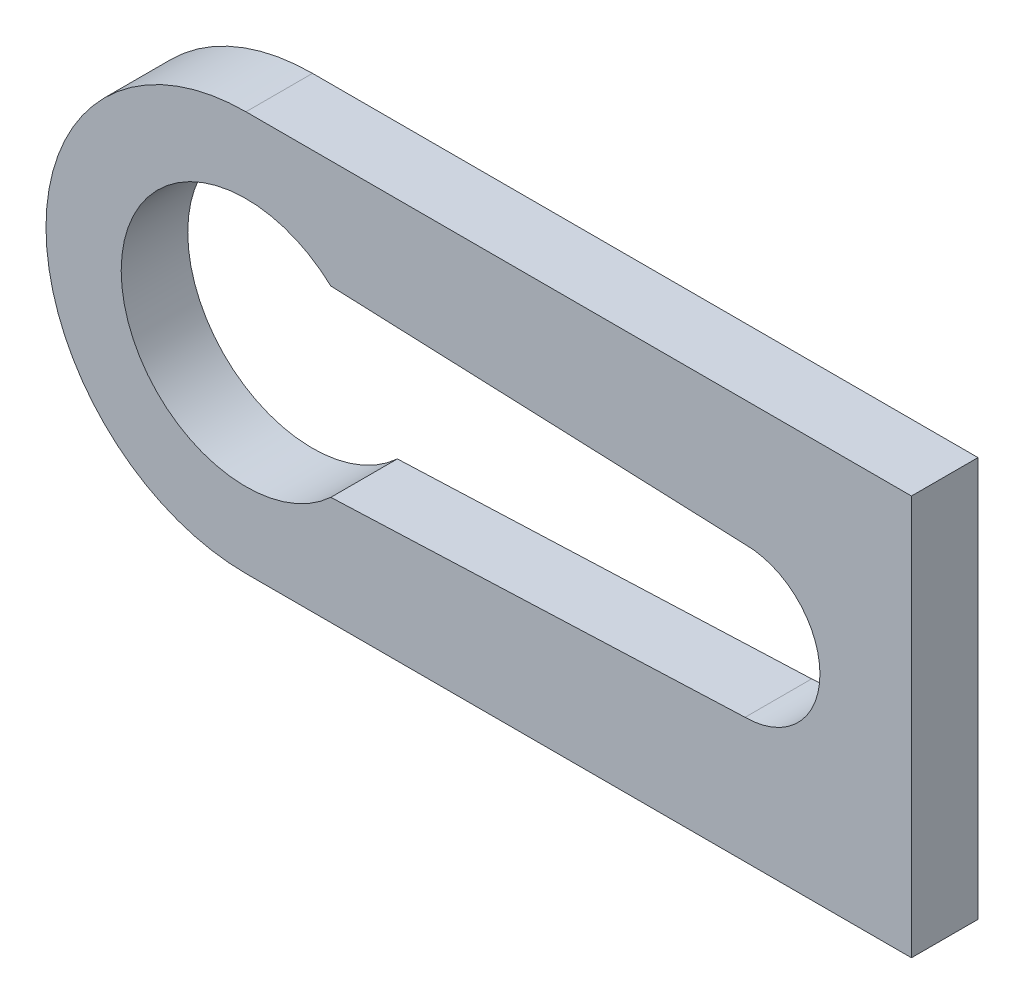
ISO-10303-21;
HEADER;
FILE_DESCRIPTION(('STEP AP214'),'2;1');
FILE_NAME('part.step','',(''),(''),'','','');
FILE_SCHEMA(('AUTOMOTIVE_DESIGN { 1 0 10303 214 1 1 1 1 }'));
ENDSEC;
DATA;
#1=APPLICATION_CONTEXT('core data for automotive mechanical design processes');
#2=APPLICATION_PROTOCOL_DEFINITION('international standard','automotive_design',2000,#1);
#3=PRODUCT_CONTEXT('',#1,'mechanical');
#4=PRODUCT('Part','Part','',(#3));
#5=PRODUCT_RELATED_PRODUCT_CATEGORY('part','',(#4));
#6=PRODUCT_DEFINITION_FORMATION('','',#4);
#7=PRODUCT_DEFINITION_CONTEXT('part definition',#1,'design');
#8=PRODUCT_DEFINITION('design','',#6,#7);
#9=PRODUCT_DEFINITION_SHAPE('','',#8);
#10=(LENGTH_UNIT() NAMED_UNIT(*) SI_UNIT(.MILLI.,.METRE.));
#11=(NAMED_UNIT(*) PLANE_ANGLE_UNIT() SI_UNIT($,.RADIAN.));
#12=(NAMED_UNIT(*) SI_UNIT($,.STERADIAN.) SOLID_ANGLE_UNIT());
#13=UNCERTAINTY_MEASURE_WITH_UNIT(LENGTH_MEASURE(1.E-05),#10,'distance_accuracy_value','');
#14=(GEOMETRIC_REPRESENTATION_CONTEXT(3) GLOBAL_UNCERTAINTY_ASSIGNED_CONTEXT((#13)) GLOBAL_UNIT_ASSIGNED_CONTEXT((#10,
#11,#12)) REPRESENTATION_CONTEXT('',''));
#15=CARTESIAN_POINT('',(0.,0.,0.));
#16=DIRECTION('',(0.,0.,1.));
#17=DIRECTION('',(1.,0.,0.));
#18=AXIS2_PLACEMENT_3D('',#15,#16,#17);
#19=CARTESIAN_POINT('',(0.,6.00975487909238,2.));
#20=DIRECTION('',(0.,1.,0.));
#21=DIRECTION('',(-1.,0.,0.));
#22=AXIS2_PLACEMENT_3D('',#19,#20,#21);
#23=PLANE('',#22);
#24=DIRECTION('',(1.,0.,0.));
#25=VECTOR('',#24,1.);
#26=CARTESIAN_POINT('',(0.,6.00975487909238,0.));
#27=LINE('',#26,#25);
#28=CARTESIAN_POINT('',(-15.,6.00975487909238,0.));
#29=VERTEX_POINT('',#28);
#30=CARTESIAN_POINT('',(5.,6.00975487909238,0.));
#31=VERTEX_POINT('',#30);
#32=EDGE_CURVE('E151',#29,#31,#27,.T.);
#33=ORIENTED_EDGE('',*,*,#32,.F.);
#34=DIRECTION('',(0.,0.,-1.));
#35=VECTOR('',#34,1.);
#36=CARTESIAN_POINT('',(-15.,6.00975487909238,2.));
#37=LINE('',#36,#35);
#38=CARTESIAN_POINT('',(-15.,6.00975487909238,2.));
#39=VERTEX_POINT('',#38);
#40=EDGE_CURVE('E11',#39,#29,#37,.T.);
#41=ORIENTED_EDGE('',*,*,#40,.F.);
#42=DIRECTION('',(1.,0.,0.));
#43=VECTOR('',#42,1.);
#44=CARTESIAN_POINT('',(0.,6.00975487909238,2.));
#45=LINE('',#44,#43);
#46=CARTESIAN_POINT('',(5.,6.00975487909238,2.));
#47=VERTEX_POINT('',#46);
#48=EDGE_CURVE('E123',#39,#47,#45,.T.);
#49=ORIENTED_EDGE('',*,*,#48,.T.);
#50=DIRECTION('',(0.,0.,-1.));
#51=VECTOR('',#50,1.);
#52=CARTESIAN_POINT('',(5.,6.00975487909238,2.));
#53=LINE('',#52,#51);
#54=EDGE_CURVE('E57',#47,#31,#53,.T.);
#55=ORIENTED_EDGE('',*,*,#54,.T.);
#56=EDGE_LOOP('',(#33,#41,#49,#55));
#57=FACE_BOUND('',#56,.T.);
#58=ADVANCED_FACE('F38',(#57),#23,.T.);
#59=CARTESIAN_POINT('',(-15.,0.,2.));
#60=DIRECTION('',(0.,0.,-1.));
#61=DIRECTION('',(-1.,0.,0.));
#62=AXIS2_PLACEMENT_3D('',#59,#60,#61);
#63=CYLINDRICAL_SURFACE('',#62,6.00975487909238);
#64=CARTESIAN_POINT('',(-15.,0.,0.));
#65=DIRECTION('',(0.,0.,1.));
#66=DIRECTION('',(1.,0.,0.));
#67=AXIS2_PLACEMENT_3D('',#64,#65,#66);
#68=CIRCLE('',#67,6.00975487909238);
#69=CARTESIAN_POINT('',(-15.,-6.00975487909238,0.));
#70=VERTEX_POINT('',#69);
#71=EDGE_CURVE('E128',#29,#70,#68,.T.);
#72=ORIENTED_EDGE('',*,*,#71,.T.);
#73=DIRECTION('',(0.,0.,-1.));
#74=VECTOR('',#73,1.);
#75=CARTESIAN_POINT('',(-15.,-6.00975487909238,2.));
#76=LINE('',#75,#74);
#77=CARTESIAN_POINT('',(-15.,-6.00975487909238,2.));
#78=VERTEX_POINT('',#77);
#79=EDGE_CURVE('E48',#78,#70,#76,.T.);
#80=ORIENTED_EDGE('',*,*,#79,.F.);
#81=CARTESIAN_POINT('',(-15.,0.,2.));
#82=DIRECTION('',(0.,0.,1.));
#83=DIRECTION('',(1.,0.,0.));
#84=AXIS2_PLACEMENT_3D('',#81,#82,#83);
#85=CIRCLE('',#84,6.00975487909238);
#86=EDGE_CURVE('E118',#39,#78,#85,.T.);
#87=ORIENTED_EDGE('',*,*,#86,.F.);
#88=ORIENTED_EDGE('',*,*,#40,.T.);
#89=EDGE_LOOP('',(#72,#80,#87,#88));
#90=FACE_BOUND('',#89,.T.);
#91=ADVANCED_FACE('F126',(#90),#63,.T.);
#92=CARTESIAN_POINT('',(0.,-6.00975487909238,2.));
#93=DIRECTION('',(0.,1.,0.));
#94=DIRECTION('',(-1.,0.,0.));
#95=AXIS2_PLACEMENT_3D('',#92,#93,#94);
#96=PLANE('',#95);
#97=DIRECTION('',(1.,0.,0.));
#98=VECTOR('',#97,1.);
#99=CARTESIAN_POINT('',(0.,-6.00975487909238,0.));
#100=LINE('',#99,#98);
#101=CARTESIAN_POINT('',(5.,-6.00975487909238,0.));
#102=VERTEX_POINT('',#101);
#103=EDGE_CURVE('E148',#70,#102,#100,.T.);
#104=ORIENTED_EDGE('',*,*,#103,.T.);
#105=DIRECTION('',(0.,0.,-1.));
#106=VECTOR('',#105,1.);
#107=CARTESIAN_POINT('',(5.,-6.00975487909238,2.));
#108=LINE('',#107,#106);
#109=CARTESIAN_POINT('',(5.,-6.00975487909238,2.));
#110=VERTEX_POINT('',#109);
#111=EDGE_CURVE('E83',#110,#102,#108,.T.);
#112=ORIENTED_EDGE('',*,*,#111,.F.);
#113=DIRECTION('',(1.,0.,0.));
#114=VECTOR('',#113,1.);
#115=CARTESIAN_POINT('',(0.,-6.00975487909238,2.));
#116=LINE('',#115,#114);
#117=EDGE_CURVE('E110',#78,#110,#116,.T.);
#118=ORIENTED_EDGE('',*,*,#117,.F.);
#119=ORIENTED_EDGE('',*,*,#79,.T.);
#120=EDGE_LOOP('',(#104,#112,#118,#119));
#121=FACE_BOUND('',#120,.T.);
#122=ADVANCED_FACE('F112',(#121),#96,.F.);
#123=CARTESIAN_POINT('',(0.,0.,2.));
#124=DIRECTION('',(0.,0.,-1.));
#125=DIRECTION('',(-1.,0.,0.));
#126=AXIS2_PLACEMENT_3D('',#123,#124,#125);
#127=CYLINDRICAL_SURFACE('',#126,2.25);
#128=CARTESIAN_POINT('',(0.,0.,0.));
#129=DIRECTION('',(0.,0.,1.));
#130=DIRECTION('',(1.,0.,0.));
#131=AXIS2_PLACEMENT_3D('',#128,#129,#130);
#132=CIRCLE('',#131,2.25);
#133=CARTESIAN_POINT('',(0.,-2.25,0.));
#134=VERTEX_POINT('',#133);
#135=CARTESIAN_POINT('',(0.,2.25,0.));
#136=VERTEX_POINT('',#135);
#137=EDGE_CURVE('E162',#134,#136,#132,.T.);
#138=ORIENTED_EDGE('',*,*,#137,.F.);
#139=DIRECTION('',(0.,0.,-1.));
#140=VECTOR('',#139,1.);
#141=CARTESIAN_POINT('',(0.,-2.25,2.));
#142=LINE('',#141,#140);
#143=CARTESIAN_POINT('',(0.,-2.25,2.));
#144=VERTEX_POINT('',#143);
#145=EDGE_CURVE('E42',#144,#134,#142,.T.);
#146=ORIENTED_EDGE('',*,*,#145,.F.);
#147=CARTESIAN_POINT('',(0.,0.,2.));
#148=DIRECTION('',(0.,0.,1.));
#149=DIRECTION('',(1.,0.,0.));
#150=AXIS2_PLACEMENT_3D('',#147,#148,#149);
#151=CIRCLE('',#150,2.25);
#152=CARTESIAN_POINT('',(0.,2.25,2.));
#153=VERTEX_POINT('',#152);
#154=EDGE_CURVE('E147',#144,#153,#151,.T.);
#155=ORIENTED_EDGE('',*,*,#154,.T.);
#156=DIRECTION('',(0.,0.,-1.));
#157=VECTOR('',#156,1.);
#158=CARTESIAN_POINT('',(0.,2.25,2.));
#159=LINE('',#158,#157);
#160=EDGE_CURVE('E133',#153,#136,#159,.T.);
#161=ORIENTED_EDGE('',*,*,#160,.T.);
#162=EDGE_LOOP('',(#138,#146,#155,#161));
#163=FACE_BOUND('',#162,.T.);
#164=ADVANCED_FACE('F40',(#163),#127,.F.);
#165=CARTESIAN_POINT('',(0.0902123977015036,-2.24637715479715,2.));
#166=DIRECTION('',(-0.0401267170784004,0.999194598952832,0.));
#167=DIRECTION('',(-0.999194598952832,-0.0401267170784004,0.));
#168=AXIS2_PLACEMENT_3D('',#165,#166,#167);
#169=PLANE('',#168);
#170=DIRECTION('',(0.999194598952832,0.0401267170784004,0.));
#171=VECTOR('',#170,1.);
#172=CARTESIAN_POINT('',(0.0902123977015036,-2.24637715479715,0.));
#173=LINE('',#172,#171);
#174=CARTESIAN_POINT('',(-12.4504902432036,-2.75,0.));
#175=VERTEX_POINT('',#174);
#176=EDGE_CURVE('E159',#175,#134,#173,.T.);
#177=ORIENTED_EDGE('',*,*,#176,.F.);
#178=DIRECTION('',(0.,0.,-1.));
#179=VECTOR('',#178,1.);
#180=CARTESIAN_POINT('',(-12.4504902432036,-2.75,2.));
#181=LINE('',#180,#179);
#182=CARTESIAN_POINT('',(-12.4504902432036,-2.75,2.));
#183=VERTEX_POINT('',#182);
#184=EDGE_CURVE('E136',#183,#175,#181,.T.);
#185=ORIENTED_EDGE('',*,*,#184,.F.);
#186=DIRECTION('',(0.999194598952832,0.0401267170784004,0.));
#187=VECTOR('',#186,1.);
#188=CARTESIAN_POINT('',(0.0902123977015036,-2.24637715479715,2.));
#189=LINE('',#188,#187);
#190=EDGE_CURVE('E171',#183,#144,#189,.T.);
#191=ORIENTED_EDGE('',*,*,#190,.T.);
#192=ORIENTED_EDGE('',*,*,#145,.T.);
#193=EDGE_LOOP('',(#177,#185,#191,#192));
#194=FACE_BOUND('',#193,.T.);
#195=ADVANCED_FACE('F178',(#194),#169,.T.);
#196=CARTESIAN_POINT('',(-15.,0.,2.));
#197=DIRECTION('',(0.,0.,-1.));
#198=DIRECTION('',(-1.,0.,0.));
#199=AXIS2_PLACEMENT_3D('',#196,#197,#198);
#200=CYLINDRICAL_SURFACE('',#199,3.75);
#201=CARTESIAN_POINT('',(-15.,0.,0.));
#202=DIRECTION('',(0.,0.,1.));
#203=DIRECTION('',(1.,0.,0.));
#204=AXIS2_PLACEMENT_3D('',#201,#202,#203);
#205=CIRCLE('',#204,3.75);
#206=CARTESIAN_POINT('',(-12.4504902432036,2.75,0.));
#207=VERTEX_POINT('',#206);
#208=EDGE_CURVE('E156',#207,#175,#205,.T.);
#209=ORIENTED_EDGE('',*,*,#208,.F.);
#210=DIRECTION('',(0.,0.,-1.));
#211=VECTOR('',#210,1.);
#212=CARTESIAN_POINT('',(-12.4504902432036,2.75,2.));
#213=LINE('',#212,#211);
#214=CARTESIAN_POINT('',(-12.4504902432036,2.75,2.));
#215=VERTEX_POINT('',#214);
#216=EDGE_CURVE('E135',#215,#207,#213,.T.);
#217=ORIENTED_EDGE('',*,*,#216,.F.);
#218=CARTESIAN_POINT('',(-15.,0.,2.));
#219=DIRECTION('',(0.,0.,1.));
#220=DIRECTION('',(1.,0.,0.));
#221=AXIS2_PLACEMENT_3D('',#218,#219,#220);
#222=CIRCLE('',#221,3.75);
#223=EDGE_CURVE('E169',#215,#183,#222,.T.);
#224=ORIENTED_EDGE('',*,*,#223,.T.);
#225=ORIENTED_EDGE('',*,*,#184,.T.);
#226=EDGE_LOOP('',(#209,#217,#224,#225));
#227=FACE_BOUND('',#226,.T.);
#228=ADVANCED_FACE('F183',(#227),#200,.F.);
#229=CARTESIAN_POINT('',(0.0902123977015036,2.24637715479715,2.));
#230=DIRECTION('',(0.0401267170784004,0.999194598952832,0.));
#231=DIRECTION('',(-0.999194598952832,0.0401267170784004,0.));
#232=AXIS2_PLACEMENT_3D('',#229,#230,#231);
#233=PLANE('',#232);
#234=DIRECTION('',(0.999194598952832,-0.0401267170784004,0.));
#235=VECTOR('',#234,1.);
#236=CARTESIAN_POINT('',(0.0902123977015036,2.24637715479715,0.));
#237=LINE('',#236,#235);
#238=EDGE_CURVE('E153',#207,#136,#237,.T.);
#239=ORIENTED_EDGE('',*,*,#238,.T.);
#240=ORIENTED_EDGE('',*,*,#160,.F.);
#241=DIRECTION('',(0.999194598952832,-0.0401267170784004,0.));
#242=VECTOR('',#241,1.);
#243=CARTESIAN_POINT('',(0.0902123977015036,2.24637715479715,2.));
#244=LINE('',#243,#242);
#245=EDGE_CURVE('E167',#215,#153,#244,.T.);
#246=ORIENTED_EDGE('',*,*,#245,.F.);
#247=ORIENTED_EDGE('',*,*,#216,.T.);
#248=EDGE_LOOP('',(#239,#240,#246,#247));
#249=FACE_BOUND('',#248,.T.);
#250=ADVANCED_FACE('F185',(#249),#233,.F.);
#251=CARTESIAN_POINT('',(5.,0.,2.));
#252=DIRECTION('',(1.,0.,0.));
#253=DIRECTION('',(0.,0.,-1.));
#254=AXIS2_PLACEMENT_3D('',#251,#252,#253);
#255=PLANE('',#254);
#256=DIRECTION('',(0.,-1.,0.));
#257=VECTOR('',#256,1.);
#258=CARTESIAN_POINT('',(5.,0.,0.));
#259=LINE('',#258,#257);
#260=EDGE_CURVE('E144',#31,#102,#259,.T.);
#261=ORIENTED_EDGE('',*,*,#260,.F.);
#262=ORIENTED_EDGE('',*,*,#54,.F.);
#263=DIRECTION('',(0.,-1.,0.));
#264=VECTOR('',#263,1.);
#265=CARTESIAN_POINT('',(5.,0.,2.));
#266=LINE('',#265,#264);
#267=EDGE_CURVE('E117',#47,#110,#266,.T.);
#268=ORIENTED_EDGE('',*,*,#267,.T.);
#269=ORIENTED_EDGE('',*,*,#111,.T.);
#270=EDGE_LOOP('',(#261,#262,#268,#269));
#271=FACE_BOUND('',#270,.T.);
#272=ADVANCED_FACE('F187',(#271),#255,.T.);
#273=CARTESIAN_POINT('',(0.,0.,2.));
#274=DIRECTION('',(0.,0.,1.));
#275=DIRECTION('',(1.,0.,0.));
#276=AXIS2_PLACEMENT_3D('',#273,#274,#275);
#277=PLANE('',#276);
#278=ORIENTED_EDGE('',*,*,#154,.F.);
#279=ORIENTED_EDGE('',*,*,#190,.F.);
#280=ORIENTED_EDGE('',*,*,#223,.F.);
#281=ORIENTED_EDGE('',*,*,#245,.T.);
#282=EDGE_LOOP('',(#278,#279,#280,#281));
#283=FACE_BOUND('',#282,.T.);
#284=ORIENTED_EDGE('',*,*,#48,.F.);
#285=ORIENTED_EDGE('',*,*,#86,.T.);
#286=ORIENTED_EDGE('',*,*,#117,.T.);
#287=ORIENTED_EDGE('',*,*,#267,.F.);
#288=EDGE_LOOP('',(#284,#285,#286,#287));
#289=FACE_BOUND('',#288,.T.);
#290=ADVANCED_FACE('F122',(#283,#289),#277,.T.);
#291=CARTESIAN_POINT('',(0.,0.,0.));
#292=DIRECTION('',(0.,0.,1.));
#293=DIRECTION('',(1.,0.,0.));
#294=AXIS2_PLACEMENT_3D('',#291,#292,#293);
#295=PLANE('',#294);
#296=ORIENTED_EDGE('',*,*,#137,.T.);
#297=ORIENTED_EDGE('',*,*,#238,.F.);
#298=ORIENTED_EDGE('',*,*,#208,.T.);
#299=ORIENTED_EDGE('',*,*,#176,.T.);
#300=EDGE_LOOP('',(#296,#297,#298,#299));
#301=FACE_BOUND('',#300,.T.);
#302=ORIENTED_EDGE('',*,*,#32,.T.);
#303=ORIENTED_EDGE('',*,*,#260,.T.);
#304=ORIENTED_EDGE('',*,*,#103,.F.);
#305=ORIENTED_EDGE('',*,*,#71,.F.);
#306=EDGE_LOOP('',(#302,#303,#304,#305));
#307=FACE_BOUND('',#306,.T.);
#308=ADVANCED_FACE('F181',(#301,#307),#295,.F.);
#309=CLOSED_SHELL('',(#58,#91,#122,#164,#195,#228,#250,#272,#290,#308));
#310=MANIFOLD_SOLID_BREP('B2',#309);
#311=ADVANCED_BREP_SHAPE_REPRESENTATION('',(#18,#310),#14);
#312=SHAPE_DEFINITION_REPRESENTATION(#9,#311);
ENDSEC;
END-ISO-10303-21;
